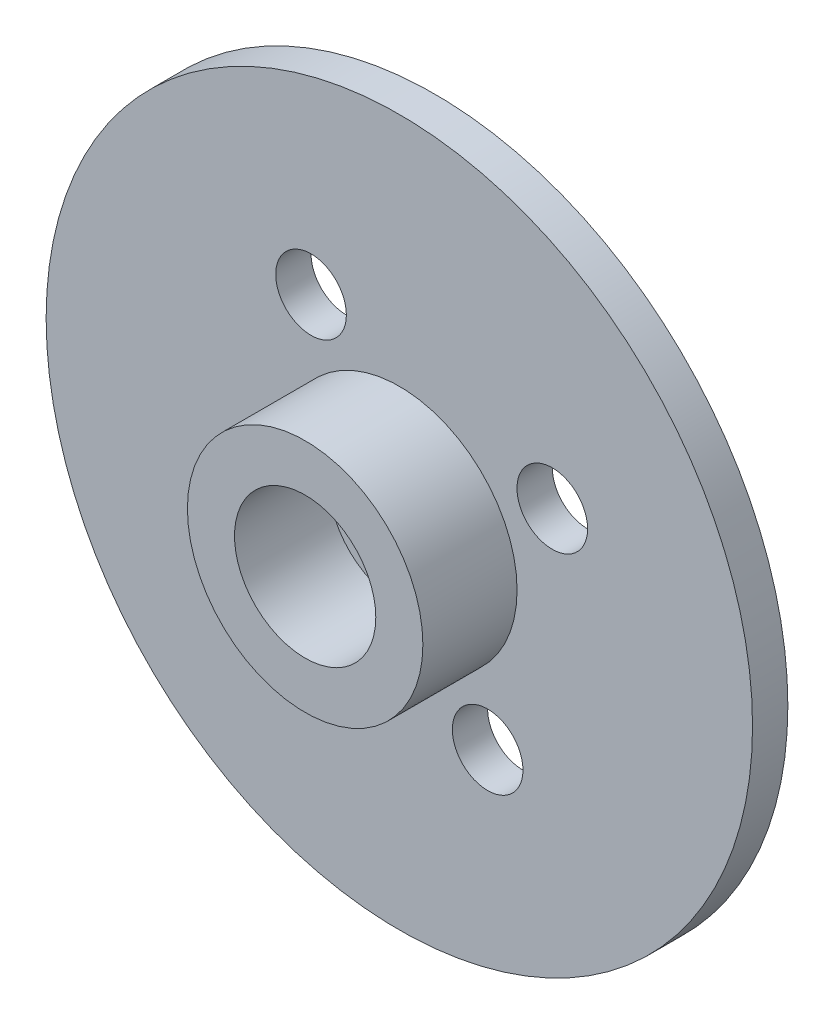
ISO-10303-21;
HEADER;
FILE_DESCRIPTION(('STEP AP214'),'2;1');
FILE_NAME('part.step','',(''),(''),'','','');
FILE_SCHEMA(('AUTOMOTIVE_DESIGN { 1 0 10303 214 1 1 1 1 }'));
ENDSEC;
DATA;
#1=APPLICATION_CONTEXT('core data for automotive mechanical design processes');
#2=APPLICATION_PROTOCOL_DEFINITION('international standard','automotive_design',2000,#1);
#3=PRODUCT_CONTEXT('',#1,'mechanical');
#4=PRODUCT('Part','Part','',(#3));
#5=PRODUCT_RELATED_PRODUCT_CATEGORY('part','',(#4));
#6=PRODUCT_DEFINITION_FORMATION('','',#4);
#7=PRODUCT_DEFINITION_CONTEXT('part definition',#1,'design');
#8=PRODUCT_DEFINITION('design','',#6,#7);
#9=PRODUCT_DEFINITION_SHAPE('','',#8);
#10=(LENGTH_UNIT() NAMED_UNIT(*) SI_UNIT(.MILLI.,.METRE.));
#11=(NAMED_UNIT(*) PLANE_ANGLE_UNIT() SI_UNIT($,.RADIAN.));
#12=(NAMED_UNIT(*) SI_UNIT($,.STERADIAN.) SOLID_ANGLE_UNIT());
#13=UNCERTAINTY_MEASURE_WITH_UNIT(LENGTH_MEASURE(1.E-05),#10,'distance_accuracy_value','');
#14=(GEOMETRIC_REPRESENTATION_CONTEXT(3) GLOBAL_UNCERTAINTY_ASSIGNED_CONTEXT((#13)) GLOBAL_UNIT_ASSIGNED_CONTEXT((#10,
#11,#12)) REPRESENTATION_CONTEXT('',''));
#15=CARTESIAN_POINT('',(0.,0.,0.));
#16=DIRECTION('',(0.,0.,1.));
#17=DIRECTION('',(1.,0.,0.));
#18=AXIS2_PLACEMENT_3D('',#15,#16,#17);
#19=CARTESIAN_POINT('',(-39.4448791972938,67.7944129826501,1.5));
#20=DIRECTION('',(0.,0.,1.));
#21=DIRECTION('',(1.,0.,0.));
#22=AXIS2_PLACEMENT_3D('',#19,#20,#21);
#23=PLANE('',#22);
#24=CARTESIAN_POINT('',(-39.4448791972938,67.7944129826501,1.5));
#25=DIRECTION('',(0.,0.,1.));
#26=DIRECTION('',(1.,0.,0.));
#27=AXIS2_PLACEMENT_3D('',#24,#25,#26);
#28=CIRCLE('',#27,0.999999999999998);
#29=CARTESIAN_POINT('',(-38.4448791972938,67.7944129826501,1.5));
#30=VERTEX_POINT('',#29);
#31=EDGE_CURVE('E86',#30,#30,#28,.T.);
#32=ORIENTED_EDGE('',*,*,#31,.F.);
#33=EDGE_LOOP('',(#32));
#34=FACE_BOUND('',#33,.T.);
#35=CARTESIAN_POINT('',(-39.4448791972938,67.7944129826501,1.5));
#36=DIRECTION('',(0.,0.,1.));
#37=DIRECTION('',(1.,0.,0.));
#38=AXIS2_PLACEMENT_3D('',#35,#36,#37);
#39=CIRCLE('',#38,3.);
#40=CARTESIAN_POINT('',(-36.4448791972938,67.7944129826501,1.5));
#41=VERTEX_POINT('',#40);
#42=EDGE_CURVE('E10',#41,#41,#39,.F.);
#43=ORIENTED_EDGE('',*,*,#42,.F.);
#44=EDGE_LOOP('',(#43));
#45=FACE_BOUND('',#44,.T.);
#46=ADVANCED_FACE('F37',(#34,#45),#23,.T.);
#47=CARTESIAN_POINT('',(-39.4448791972938,67.7944129826501,1.5));
#48=DIRECTION('',(0.,0.,1.));
#49=DIRECTION('',(1.,0.,0.));
#50=AXIS2_PLACEMENT_3D('',#47,#48,#49);
#51=CIRCLE('',#50,5.00000000000001);
#52=CARTESIAN_POINT('',(-34.4448791972938,67.7944129826501,1.5));
#53=VERTEX_POINT('',#52);
#54=EDGE_CURVE('E98',#53,#53,#51,.T.);
#55=ORIENTED_EDGE('',*,*,#54,.F.);
#56=EDGE_LOOP('',(#55));
#57=FACE_BOUND('',#56,.T.);
#58=CARTESIAN_POINT('',(-45.9400697256772,64.0444129826502,1.5));
#59=DIRECTION('',(0.,0.,1.));
#60=DIRECTION('',(1.,0.,0.));
#61=AXIS2_PLACEMENT_3D('',#58,#59,#60);
#62=CIRCLE('',#61,1.5);
#63=CARTESIAN_POINT('',(-44.4400697256772,64.0444129826502,1.5));
#64=VERTEX_POINT('',#63);
#65=EDGE_CURVE('E78',#64,#64,#62,.T.);
#66=ORIENTED_EDGE('',*,*,#65,.F.);
#67=EDGE_LOOP('',(#66));
#68=FACE_BOUND('',#67,.T.);
#69=CARTESIAN_POINT('',(-43.1948791972938,74.2896035110334,1.5));
#70=DIRECTION('',(0.,0.,1.));
#71=DIRECTION('',(1.,0.,0.));
#72=AXIS2_PLACEMENT_3D('',#69,#70,#71);
#73=CIRCLE('',#72,1.5);
#74=CARTESIAN_POINT('',(-41.6948791972938,74.2896035110334,1.5));
#75=VERTEX_POINT('',#74);
#76=EDGE_CURVE('E62',#75,#75,#73,.T.);
#77=ORIENTED_EDGE('',*,*,#76,.F.);
#78=EDGE_LOOP('',(#77));
#79=FACE_BOUND('',#78,.T.);
#80=CARTESIAN_POINT('',(-39.4448791972938,67.7944129826501,1.5));
#81=DIRECTION('',(0.,0.,1.));
#82=DIRECTION('',(1.,0.,0.));
#83=AXIS2_PLACEMENT_3D('',#80,#81,#82);
#84=CIRCLE('',#83,15.);
#85=CARTESIAN_POINT('',(-24.4448791972938,67.7944129826501,1.5));
#86=VERTEX_POINT('',#85);
#87=EDGE_CURVE('E45',#86,#86,#84,.T.);
#88=ORIENTED_EDGE('',*,*,#87,.T.);
#89=EDGE_LOOP('',(#88));
#90=FACE_BOUND('',#89,.T.);
#91=CARTESIAN_POINT('',(-35.6948791972938,61.2992224542668,1.5));
#92=DIRECTION('',(0.,0.,1.));
#93=DIRECTION('',(1.,0.,0.));
#94=AXIS2_PLACEMENT_3D('',#91,#92,#93);
#95=CIRCLE('',#94,1.5);
#96=CARTESIAN_POINT('',(-34.1948791972938,61.2992224542668,1.5));
#97=VERTEX_POINT('',#96);
#98=EDGE_CURVE('E56',#97,#97,#95,.T.);
#99=ORIENTED_EDGE('',*,*,#98,.F.);
#100=EDGE_LOOP('',(#99));
#101=FACE_BOUND('',#100,.T.);
#102=CARTESIAN_POINT('',(-32.9496886689105,71.5444129826501,1.5));
#103=DIRECTION('',(0.,0.,1.));
#104=DIRECTION('',(1.,0.,0.));
#105=AXIS2_PLACEMENT_3D('',#102,#103,#104);
#106=CIRCLE('',#105,1.5);
#107=CARTESIAN_POINT('',(-31.4496886689105,71.5444129826501,1.5));
#108=VERTEX_POINT('',#107);
#109=EDGE_CURVE('E70',#108,#108,#106,.T.);
#110=ORIENTED_EDGE('',*,*,#109,.F.);
#111=EDGE_LOOP('',(#110));
#112=FACE_BOUND('',#111,.T.);
#113=ADVANCED_FACE('F129',(#57,#68,#79,#90,#101,#112),#23,.T.);
#114=CARTESIAN_POINT('',(-39.4448791972938,67.7944129826501,0.));
#115=DIRECTION('',(0.,0.,1.));
#116=DIRECTION('',(1.,0.,0.));
#117=AXIS2_PLACEMENT_3D('',#114,#115,#116);
#118=PLANE('',#117);
#119=CARTESIAN_POINT('',(-39.4448791972938,67.7944129826501,0.));
#120=DIRECTION('',(0.,0.,1.));
#121=DIRECTION('',(1.,0.,0.));
#122=AXIS2_PLACEMENT_3D('',#119,#120,#121);
#123=CIRCLE('',#122,15.);
#124=CARTESIAN_POINT('',(-24.4448791972938,67.7944129826501,0.));
#125=VERTEX_POINT('',#124);
#126=EDGE_CURVE('E50',#125,#125,#123,.T.);
#127=ORIENTED_EDGE('',*,*,#126,.F.);
#128=EDGE_LOOP('',(#127));
#129=FACE_BOUND('',#128,.T.);
#130=CARTESIAN_POINT('',(-35.6948791972938,61.2992224542668,0.));
#131=DIRECTION('',(0.,0.,1.));
#132=DIRECTION('',(1.,0.,0.));
#133=AXIS2_PLACEMENT_3D('',#130,#131,#132);
#134=CIRCLE('',#133,1.5);
#135=CARTESIAN_POINT('',(-34.1948791972938,61.2992224542668,0.));
#136=VERTEX_POINT('',#135);
#137=EDGE_CURVE('E58',#136,#136,#134,.T.);
#138=ORIENTED_EDGE('',*,*,#137,.T.);
#139=EDGE_LOOP('',(#138));
#140=FACE_BOUND('',#139,.T.);
#141=CARTESIAN_POINT('',(-43.1948791972938,74.2896035110334,0.));
#142=DIRECTION('',(0.,0.,1.));
#143=DIRECTION('',(1.,0.,0.));
#144=AXIS2_PLACEMENT_3D('',#141,#142,#143);
#145=CIRCLE('',#144,1.5);
#146=CARTESIAN_POINT('',(-41.6948791972938,74.2896035110334,0.));
#147=VERTEX_POINT('',#146);
#148=EDGE_CURVE('E66',#147,#147,#145,.T.);
#149=ORIENTED_EDGE('',*,*,#148,.T.);
#150=EDGE_LOOP('',(#149));
#151=FACE_BOUND('',#150,.T.);
#152=CARTESIAN_POINT('',(-32.9496886689105,71.5444129826501,0.));
#153=DIRECTION('',(0.,0.,1.));
#154=DIRECTION('',(1.,0.,0.));
#155=AXIS2_PLACEMENT_3D('',#152,#153,#154);
#156=CIRCLE('',#155,1.5);
#157=CARTESIAN_POINT('',(-31.4496886689105,71.5444129826501,0.));
#158=VERTEX_POINT('',#157);
#159=EDGE_CURVE('E74',#158,#158,#156,.T.);
#160=ORIENTED_EDGE('',*,*,#159,.T.);
#161=EDGE_LOOP('',(#160));
#162=FACE_BOUND('',#161,.T.);
#163=CARTESIAN_POINT('',(-45.9400697256772,64.0444129826502,0.));
#164=DIRECTION('',(0.,0.,1.));
#165=DIRECTION('',(1.,0.,0.));
#166=AXIS2_PLACEMENT_3D('',#163,#164,#165);
#167=CIRCLE('',#166,1.5);
#168=CARTESIAN_POINT('',(-44.4400697256772,64.0444129826502,0.));
#169=VERTEX_POINT('',#168);
#170=EDGE_CURVE('E82',#169,#169,#167,.T.);
#171=ORIENTED_EDGE('',*,*,#170,.T.);
#172=EDGE_LOOP('',(#171));
#173=FACE_BOUND('',#172,.T.);
#174=CARTESIAN_POINT('',(-39.4448791972938,67.7944129826501,0.));
#175=DIRECTION('',(0.,0.,1.));
#176=DIRECTION('',(1.,0.,0.));
#177=AXIS2_PLACEMENT_3D('',#174,#175,#176);
#178=CIRCLE('',#177,0.999999999999998);
#179=CARTESIAN_POINT('',(-38.4448791972938,67.7944129826501,0.));
#180=VERTEX_POINT('',#179);
#181=EDGE_CURVE('E90',#180,#180,#178,.T.);
#182=ORIENTED_EDGE('',*,*,#181,.T.);
#183=EDGE_LOOP('',(#182));
#184=FACE_BOUND('',#183,.T.);
#185=ADVANCED_FACE('F135',(#129,#140,#151,#162,#173,#184),#118,.F.);
#186=CARTESIAN_POINT('',(-39.4448791972938,67.7944129826501,1.5));
#187=DIRECTION('',(0.,0.,-1.));
#188=DIRECTION('',(-1.,0.,0.));
#189=AXIS2_PLACEMENT_3D('',#186,#187,#188);
#190=CYLINDRICAL_SURFACE('',#189,15.);
#191=ORIENTED_EDGE('',*,*,#87,.F.);
#192=EDGE_LOOP('',(#191));
#193=FACE_BOUND('',#192,.T.);
#194=ORIENTED_EDGE('',*,*,#126,.T.);
#195=EDGE_LOOP('',(#194));
#196=FACE_BOUND('',#195,.T.);
#197=ADVANCED_FACE('F39',(#193,#196),#190,.T.);
#198=CARTESIAN_POINT('',(-35.6948791972938,61.2992224542668,1.5));
#199=DIRECTION('',(0.,0.,-1.));
#200=DIRECTION('',(-1.,0.,0.));
#201=AXIS2_PLACEMENT_3D('',#198,#199,#200);
#202=CYLINDRICAL_SURFACE('',#201,1.5);
#203=ORIENTED_EDGE('',*,*,#98,.T.);
#204=EDGE_LOOP('',(#203));
#205=FACE_BOUND('',#204,.T.);
#206=ORIENTED_EDGE('',*,*,#137,.F.);
#207=EDGE_LOOP('',(#206));
#208=FACE_BOUND('',#207,.T.);
#209=ADVANCED_FACE('F140',(#205,#208),#202,.F.);
#210=CARTESIAN_POINT('',(-43.1948791972938,74.2896035110334,1.5));
#211=DIRECTION('',(0.,0.,-1.));
#212=DIRECTION('',(-1.,0.,0.));
#213=AXIS2_PLACEMENT_3D('',#210,#211,#212);
#214=CYLINDRICAL_SURFACE('',#213,1.5);
#215=ORIENTED_EDGE('',*,*,#76,.T.);
#216=EDGE_LOOP('',(#215));
#217=FACE_BOUND('',#216,.T.);
#218=ORIENTED_EDGE('',*,*,#148,.F.);
#219=EDGE_LOOP('',(#218));
#220=FACE_BOUND('',#219,.T.);
#221=ADVANCED_FACE('F168',(#217,#220),#214,.F.);
#222=CARTESIAN_POINT('',(-32.9496886689105,71.5444129826501,1.5));
#223=DIRECTION('',(0.,0.,-1.));
#224=DIRECTION('',(-1.,0.,0.));
#225=AXIS2_PLACEMENT_3D('',#222,#223,#224);
#226=CYLINDRICAL_SURFACE('',#225,1.5);
#227=ORIENTED_EDGE('',*,*,#109,.T.);
#228=EDGE_LOOP('',(#227));
#229=FACE_BOUND('',#228,.T.);
#230=ORIENTED_EDGE('',*,*,#159,.F.);
#231=EDGE_LOOP('',(#230));
#232=FACE_BOUND('',#231,.T.);
#233=ADVANCED_FACE('F162',(#229,#232),#226,.F.);
#234=CARTESIAN_POINT('',(-45.9400697256772,64.0444129826502,1.5));
#235=DIRECTION('',(0.,0.,-1.));
#236=DIRECTION('',(-1.,0.,0.));
#237=AXIS2_PLACEMENT_3D('',#234,#235,#236);
#238=CYLINDRICAL_SURFACE('',#237,1.5);
#239=ORIENTED_EDGE('',*,*,#65,.T.);
#240=EDGE_LOOP('',(#239));
#241=FACE_BOUND('',#240,.T.);
#242=ORIENTED_EDGE('',*,*,#170,.F.);
#243=EDGE_LOOP('',(#242));
#244=FACE_BOUND('',#243,.T.);
#245=ADVANCED_FACE('F124',(#241,#244),#238,.F.);
#246=CARTESIAN_POINT('',(-39.4448791972938,67.7944129826501,1.5));
#247=DIRECTION('',(0.,0.,-1.));
#248=DIRECTION('',(-1.,0.,0.));
#249=AXIS2_PLACEMENT_3D('',#246,#247,#248);
#250=CYLINDRICAL_SURFACE('',#249,0.999999999999998);
#251=ORIENTED_EDGE('',*,*,#31,.T.);
#252=EDGE_LOOP('',(#251));
#253=FACE_BOUND('',#252,.T.);
#254=ORIENTED_EDGE('',*,*,#181,.F.);
#255=EDGE_LOOP('',(#254));
#256=FACE_BOUND('',#255,.T.);
#257=ADVANCED_FACE('F115',(#253,#256),#250,.F.);
#258=CARTESIAN_POINT('',(-39.4448791972938,67.7944129826501,5.5));
#259=DIRECTION('',(0.,0.,1.));
#260=DIRECTION('',(1.,0.,0.));
#261=AXIS2_PLACEMENT_3D('',#258,#259,#260);
#262=PLANE('',#261);
#263=CARTESIAN_POINT('',(-39.4448791972938,67.7944129826501,5.5));
#264=DIRECTION('',(0.,0.,1.));
#265=DIRECTION('',(1.,0.,0.));
#266=AXIS2_PLACEMENT_3D('',#263,#264,#265);
#267=CIRCLE('',#266,5.00000000000001);
#268=CARTESIAN_POINT('',(-34.4448791972938,67.7944129826501,5.5));
#269=VERTEX_POINT('',#268);
#270=EDGE_CURVE('E94',#269,#269,#267,.T.);
#271=ORIENTED_EDGE('',*,*,#270,.T.);
#272=EDGE_LOOP('',(#271));
#273=FACE_BOUND('',#272,.T.);
#274=CARTESIAN_POINT('',(-39.4448791972938,67.7944129826501,5.5));
#275=DIRECTION('',(0.,0.,1.));
#276=DIRECTION('',(1.,0.,0.));
#277=AXIS2_PLACEMENT_3D('',#274,#275,#276);
#278=CIRCLE('',#277,3.);
#279=CARTESIAN_POINT('',(-36.4448791972938,67.7944129826501,5.5));
#280=VERTEX_POINT('',#279);
#281=EDGE_CURVE('E102',#280,#280,#278,.T.);
#282=ORIENTED_EDGE('',*,*,#281,.F.);
#283=EDGE_LOOP('',(#282));
#284=FACE_BOUND('',#283,.T.);
#285=ADVANCED_FACE('F112',(#273,#284),#262,.T.);
#286=CARTESIAN_POINT('',(-39.4448791972938,67.7944129826501,5.5));
#287=DIRECTION('',(0.,0.,-1.));
#288=DIRECTION('',(-1.,0.,0.));
#289=AXIS2_PLACEMENT_3D('',#286,#287,#288);
#290=CYLINDRICAL_SURFACE('',#289,5.00000000000001);
#291=ORIENTED_EDGE('',*,*,#270,.F.);
#292=EDGE_LOOP('',(#291));
#293=FACE_BOUND('',#292,.T.);
#294=ORIENTED_EDGE('',*,*,#54,.T.);
#295=EDGE_LOOP('',(#294));
#296=FACE_BOUND('',#295,.T.);
#297=ADVANCED_FACE('F114',(#293,#296),#290,.T.);
#298=CARTESIAN_POINT('',(-39.4448791972938,67.7944129826501,5.5));
#299=DIRECTION('',(0.,0.,-1.));
#300=DIRECTION('',(-1.,0.,0.));
#301=AXIS2_PLACEMENT_3D('',#298,#299,#300);
#302=CYLINDRICAL_SURFACE('',#301,3.);
#303=ORIENTED_EDGE('',*,*,#281,.T.);
#304=EDGE_LOOP('',(#303));
#305=FACE_BOUND('',#304,.T.);
#306=ORIENTED_EDGE('',*,*,#42,.T.);
#307=EDGE_LOOP('',(#306));
#308=FACE_BOUND('',#307,.T.);
#309=ADVANCED_FACE('F110',(#305,#308),#302,.F.);
#310=CLOSED_SHELL('',(#46,#113,#185,#197,#209,#221,#233,#245,#257,#285,#297,#309));
#311=MANIFOLD_SOLID_BREP('B2',#310);
#312=ADVANCED_BREP_SHAPE_REPRESENTATION('',(#18,#311),#14);
#313=SHAPE_DEFINITION_REPRESENTATION(#9,#312);
ENDSEC;
END-ISO-10303-21;
